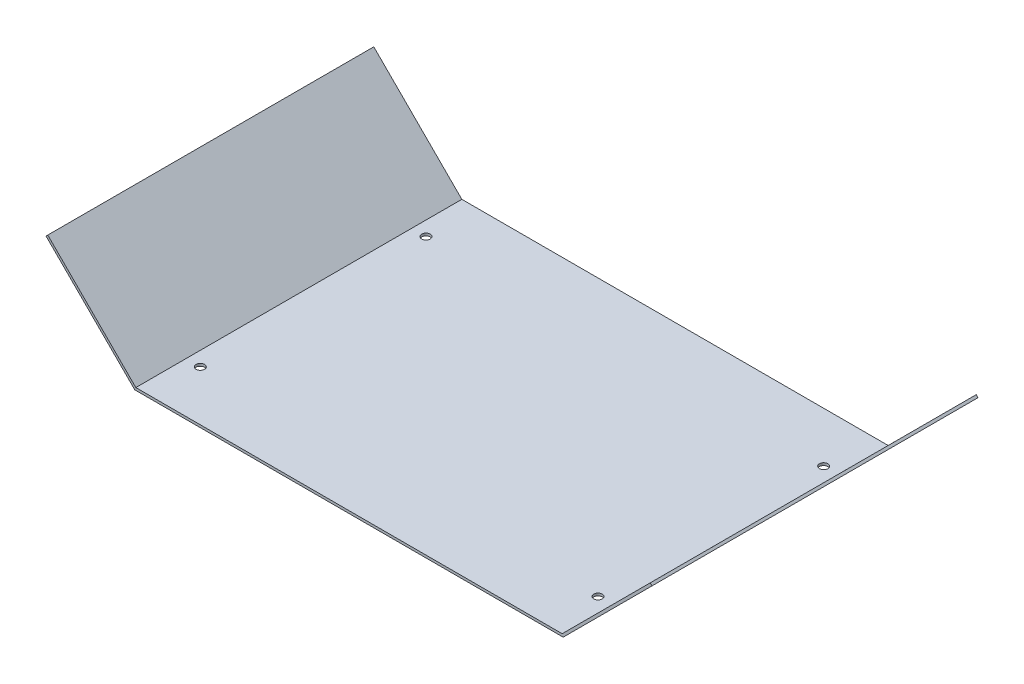
ISO-10303-21;
HEADER;
FILE_DESCRIPTION(('STEP AP214'),'2;1');
FILE_NAME('part.step','',(''),(''),'','','');
FILE_SCHEMA(('AUTOMOTIVE_DESIGN { 1 0 10303 214 1 1 1 1 }'));
ENDSEC;
DATA;
#1=APPLICATION_CONTEXT('core data for automotive mechanical design processes');
#2=APPLICATION_PROTOCOL_DEFINITION('international standard','automotive_design',2000,#1);
#3=PRODUCT_CONTEXT('',#1,'mechanical');
#4=PRODUCT('Part','Part','',(#3));
#5=PRODUCT_RELATED_PRODUCT_CATEGORY('part','',(#4));
#6=PRODUCT_DEFINITION_FORMATION('','',#4);
#7=PRODUCT_DEFINITION_CONTEXT('part definition',#1,'design');
#8=PRODUCT_DEFINITION('design','',#6,#7);
#9=PRODUCT_DEFINITION_SHAPE('','',#8);
#10=(LENGTH_UNIT() NAMED_UNIT(*) SI_UNIT(.MILLI.,.METRE.));
#11=(NAMED_UNIT(*) PLANE_ANGLE_UNIT() SI_UNIT($,.RADIAN.));
#12=(NAMED_UNIT(*) SI_UNIT($,.STERADIAN.) SOLID_ANGLE_UNIT());
#13=UNCERTAINTY_MEASURE_WITH_UNIT(LENGTH_MEASURE(1.E-05),#10,'distance_accuracy_value','');
#14=(GEOMETRIC_REPRESENTATION_CONTEXT(3) GLOBAL_UNCERTAINTY_ASSIGNED_CONTEXT((#13)) GLOBAL_UNIT_ASSIGNED_CONTEXT((#10,
#11,#12)) REPRESENTATION_CONTEXT('',''));
#15=CARTESIAN_POINT('',(0.,0.,0.));
#16=DIRECTION('',(0.,0.,1.));
#17=DIRECTION('',(1.,0.,0.));
#18=AXIS2_PLACEMENT_3D('',#15,#16,#17);
#19=CARTESIAN_POINT('',(146.649414842146,-0.707116678078054,130.));
#20=DIRECTION('',(-0.707096884156519,0.707116678078054,0.));
#21=DIRECTION('',(-0.707116678078054,-0.70709688415652,0.));
#22=AXIS2_PLACEMENT_3D('',#19,#20,#21);
#23=PLANE('',#22);
#24=DIRECTION('',(0.707116678078054,0.70709688415652,0.));
#25=VECTOR('',#24,1.);
#26=CARTESIAN_POINT('',(146.649414842146,-0.707116678078054,0.));
#27=LINE('',#26,#25);
#28=CARTESIAN_POINT('',(146.356523321475,-1.,0.));
#29=VERTEX_POINT('',#28);
#30=CARTESIAN_POINT('',(181.763414842145,34.4059003953664,0.));
#31=VERTEX_POINT('',#30);
#32=EDGE_CURVE('E128',#29,#31,#27,.T.);
#33=ORIENTED_EDGE('',*,*,#32,.T.);
#34=DIRECTION('',(0.,0.,-1.));
#35=VECTOR('',#34,1.);
#36=CARTESIAN_POINT('',(181.763414842145,34.4059003953664,130.));
#37=LINE('',#36,#35);
#38=CARTESIAN_POINT('',(181.763414842145,34.4059003953664,130.));
#39=VERTEX_POINT('',#38);
#40=EDGE_CURVE('E11',#39,#31,#37,.T.);
#41=ORIENTED_EDGE('',*,*,#40,.F.);
#42=DIRECTION('',(0.707116678078054,0.70709688415652,0.));
#43=VECTOR('',#42,1.);
#44=CARTESIAN_POINT('',(146.649414842146,-0.707116678078054,130.));
#45=LINE('',#44,#43);
#46=CARTESIAN_POINT('',(146.356523321475,-1.,130.));
#47=VERTEX_POINT('',#46);
#48=EDGE_CURVE('E86',#47,#39,#45,.T.);
#49=ORIENTED_EDGE('',*,*,#48,.F.);
#50=DIRECTION('',(0.,0.,-1.));
#51=VECTOR('',#50,1.);
#52=CARTESIAN_POINT('',(146.356523321475,-1.,130.));
#53=LINE('',#52,#51);
#54=EDGE_CURVE('E127',#47,#29,#53,.T.);
#55=ORIENTED_EDGE('',*,*,#54,.T.);
#56=EDGE_LOOP('',(#33,#41,#49,#55));
#57=FACE_BOUND('',#56,.T.);
#58=ADVANCED_FACE('F31',(#57),#23,.F.);
#59=CARTESIAN_POINT('',(181.056317957989,35.1130170734444,130.));
#60=DIRECTION('',(0.707116678078055,0.707096884156518,0.));
#61=DIRECTION('',(-0.707096884156518,0.707116678078055,0.));
#62=AXIS2_PLACEMENT_3D('',#59,#60,#61);
#63=PLANE('',#62);
#64=DIRECTION('',(0.707096884156518,-0.707116678078055,0.));
#65=VECTOR('',#64,1.);
#66=CARTESIAN_POINT('',(181.056317957989,35.1130170734444,0.));
#67=LINE('',#66,#65);
#68=CARTESIAN_POINT('',(181.056317957989,35.1130170734444,0.));
#69=VERTEX_POINT('',#68);
#70=EDGE_CURVE('E131',#69,#31,#67,.T.);
#71=ORIENTED_EDGE('',*,*,#70,.F.);
#72=DIRECTION('',(0.,0.,-1.));
#73=VECTOR('',#72,1.);
#74=CARTESIAN_POINT('',(181.056317957989,35.1130170734444,130.));
#75=LINE('',#74,#73);
#76=CARTESIAN_POINT('',(181.056317957989,35.1130170734444,130.));
#77=VERTEX_POINT('',#76);
#78=EDGE_CURVE('E39',#77,#69,#75,.T.);
#79=ORIENTED_EDGE('',*,*,#78,.F.);
#80=DIRECTION('',(0.707096884156518,-0.707116678078055,0.));
#81=VECTOR('',#80,1.);
#82=CARTESIAN_POINT('',(181.056317957989,35.1130170734444,130.));
#83=LINE('',#82,#81);
#84=EDGE_CURVE('E171',#77,#39,#83,.T.);
#85=ORIENTED_EDGE('',*,*,#84,.T.);
#86=ORIENTED_EDGE('',*,*,#40,.T.);
#87=EDGE_LOOP('',(#71,#79,#85,#86));
#88=FACE_BOUND('',#87,.T.);
#89=ADVANCED_FACE('F162',(#88),#63,.T.);
#90=CARTESIAN_POINT('',(145.942317957989,0.,130.));
#91=DIRECTION('',(-0.707096884156519,0.707116678078054,0.));
#92=DIRECTION('',(-0.707116678078054,-0.70709688415652,0.));
#93=AXIS2_PLACEMENT_3D('',#90,#91,#92);
#94=PLANE('',#93);
#95=DIRECTION('',(0.707116678078054,0.70709688415652,0.));
#96=VECTOR('',#95,1.);
#97=CARTESIAN_POINT('',(145.942317957989,0.,0.));
#98=LINE('',#97,#96);
#99=CARTESIAN_POINT('',(145.942317957989,0.,0.));
#100=VERTEX_POINT('',#99);
#101=EDGE_CURVE('E135',#100,#69,#98,.T.);
#102=ORIENTED_EDGE('',*,*,#101,.F.);
#103=DIRECTION('',(0.,0.,-1.));
#104=VECTOR('',#103,1.);
#105=CARTESIAN_POINT('',(145.942317957989,0.,130.));
#106=LINE('',#105,#104);
#107=CARTESIAN_POINT('',(145.942317957989,0.,130.));
#108=VERTEX_POINT('',#107);
#109=EDGE_CURVE('E152',#108,#100,#106,.T.);
#110=ORIENTED_EDGE('',*,*,#109,.F.);
#111=DIRECTION('',(0.707116678078054,0.70709688415652,0.));
#112=VECTOR('',#111,1.);
#113=CARTESIAN_POINT('',(145.942317957989,0.,130.));
#114=LINE('',#113,#112);
#115=EDGE_CURVE('E159',#108,#77,#114,.T.);
#116=ORIENTED_EDGE('',*,*,#115,.T.);
#117=ORIENTED_EDGE('',*,*,#78,.T.);
#118=EDGE_LOOP('',(#102,#110,#116,#117));
#119=FACE_BOUND('',#118,.T.);
#120=ADVANCED_FACE('F157',(#119),#94,.T.);
#121=CARTESIAN_POINT('',(-24.057682042011,0.,130.));
#122=DIRECTION('',(0.,1.,0.));
#123=DIRECTION('',(0.,0.,1.));
#124=AXIS2_PLACEMENT_3D('',#121,#122,#123);
#125=PLANE('',#124);
#126=CARTESIAN_POINT('',(-18.357682042011,0.,20.));
#127=DIRECTION('',(0.,1.,0.));
#128=DIRECTION('',(0.,0.,1.));
#129=AXIS2_PLACEMENT_3D('',#126,#127,#128);
#130=CIRCLE('',#129,1.69999999999999);
#131=CARTESIAN_POINT('',(-18.357682042011,0.,21.7));
#132=VERTEX_POINT('',#131);
#133=EDGE_CURVE('E196',#132,#132,#130,.T.);
#134=ORIENTED_EDGE('',*,*,#133,.F.);
#135=EDGE_LOOP('',(#134));
#136=FACE_BOUND('',#135,.T.);
#137=CARTESIAN_POINT('',(140.242317957989,0.,20.));
#138=DIRECTION('',(0.,1.,0.));
#139=DIRECTION('',(0.,0.,1.));
#140=AXIS2_PLACEMENT_3D('',#137,#138,#139);
#141=CIRCLE('',#140,1.69999999999998);
#142=CARTESIAN_POINT('',(140.242317957989,0.,21.7));
#143=VERTEX_POINT('',#142);
#144=EDGE_CURVE('E190',#143,#143,#141,.T.);
#145=ORIENTED_EDGE('',*,*,#144,.F.);
#146=EDGE_LOOP('',(#145));
#147=FACE_BOUND('',#146,.T.);
#148=CARTESIAN_POINT('',(140.242317957989,0.,110.));
#149=DIRECTION('',(0.,1.,0.));
#150=DIRECTION('',(0.,0.,1.));
#151=AXIS2_PLACEMENT_3D('',#148,#149,#150);
#152=CIRCLE('',#151,1.69999999999998);
#153=CARTESIAN_POINT('',(140.242317957989,0.,111.7));
#154=VERTEX_POINT('',#153);
#155=EDGE_CURVE('E184',#154,#154,#152,.T.);
#156=ORIENTED_EDGE('',*,*,#155,.F.);
#157=EDGE_LOOP('',(#156));
#158=FACE_BOUND('',#157,.T.);
#159=CARTESIAN_POINT('',(-18.357682042011,0.,110.));
#160=DIRECTION('',(0.,1.,0.));
#161=DIRECTION('',(0.,0.,1.));
#162=AXIS2_PLACEMENT_3D('',#159,#160,#161);
#163=CIRCLE('',#162,1.69999999999999);
#164=CARTESIAN_POINT('',(-18.357682042011,0.,111.7));
#165=VERTEX_POINT('',#164);
#166=EDGE_CURVE('E178',#165,#165,#163,.T.);
#167=ORIENTED_EDGE('',*,*,#166,.F.);
#168=EDGE_LOOP('',(#167));
#169=FACE_BOUND('',#168,.T.);
#170=DIRECTION('',(1.,0.,0.));
#171=VECTOR('',#170,1.);
#172=CARTESIAN_POINT('',(-24.057682042011,0.,0.));
#173=LINE('',#172,#171);
#174=CARTESIAN_POINT('',(-24.057682042011,0.,0.));
#175=VERTEX_POINT('',#174);
#176=EDGE_CURVE('E138',#175,#100,#173,.T.);
#177=ORIENTED_EDGE('',*,*,#176,.F.);
#178=DIRECTION('',(0.,0.,-1.));
#179=VECTOR('',#178,1.);
#180=CARTESIAN_POINT('',(-24.057682042011,0.,130.));
#181=LINE('',#180,#179);
#182=CARTESIAN_POINT('',(-24.057682042011,0.,130.));
#183=VERTEX_POINT('',#182);
#184=EDGE_CURVE('E150',#183,#175,#181,.T.);
#185=ORIENTED_EDGE('',*,*,#184,.F.);
#186=DIRECTION('',(1.,0.,0.));
#187=VECTOR('',#186,1.);
#188=CARTESIAN_POINT('',(-24.057682042011,0.,130.));
#189=LINE('',#188,#187);
#190=EDGE_CURVE('E122',#183,#108,#189,.T.);
#191=ORIENTED_EDGE('',*,*,#190,.T.);
#192=ORIENTED_EDGE('',*,*,#109,.T.);
#193=EDGE_LOOP('',(#177,#185,#191,#192));
#194=FACE_BOUND('',#193,.T.);
#195=ADVANCED_FACE('F169',(#136,#147,#158,#169,#194),#125,.T.);
#196=CARTESIAN_POINT('',(-59.1706991154554,35.114,130.));
#197=DIRECTION('',(0.707116678078054,0.707096884156519,0.));
#198=DIRECTION('',(-0.707096884156519,0.707116678078054,0.));
#199=AXIS2_PLACEMENT_3D('',#196,#197,#198);
#200=PLANE('',#199);
#201=DIRECTION('',(0.707096884156519,-0.707116678078054,0.));
#202=VECTOR('',#201,1.);
#203=CARTESIAN_POINT('',(-59.1706991154554,35.114,0.));
#204=LINE('',#203,#202);
#205=CARTESIAN_POINT('',(-59.1706991154554,35.114,0.));
#206=VERTEX_POINT('',#205);
#207=EDGE_CURVE('E141',#206,#175,#204,.T.);
#208=ORIENTED_EDGE('',*,*,#207,.F.);
#209=DIRECTION('',(0.,0.,-1.));
#210=VECTOR('',#209,1.);
#211=CARTESIAN_POINT('',(-59.1706991154554,35.114,130.));
#212=LINE('',#211,#210);
#213=CARTESIAN_POINT('',(-59.1706991154554,35.114,130.));
#214=VERTEX_POINT('',#213);
#215=EDGE_CURVE('E110',#214,#206,#212,.T.);
#216=ORIENTED_EDGE('',*,*,#215,.F.);
#217=DIRECTION('',(0.707096884156519,-0.707116678078054,0.));
#218=VECTOR('',#217,1.);
#219=CARTESIAN_POINT('',(-59.1706991154554,35.114,130.));
#220=LINE('',#219,#218);
#221=EDGE_CURVE('E120',#214,#183,#220,.T.);
#222=ORIENTED_EDGE('',*,*,#221,.T.);
#223=ORIENTED_EDGE('',*,*,#184,.T.);
#224=EDGE_LOOP('',(#208,#216,#222,#223));
#225=FACE_BOUND('',#224,.T.);
#226=ADVANCED_FACE('F204',(#225),#200,.T.);
#227=CARTESIAN_POINT('',(-59.8778157935335,34.4069031158435,130.));
#228=DIRECTION('',(-0.707096884156518,0.707116678078055,0.));
#229=DIRECTION('',(-0.707116678078055,-0.707096884156518,0.));
#230=AXIS2_PLACEMENT_3D('',#227,#228,#229);
#231=PLANE('',#230);
#232=DIRECTION('',(0.707116678078055,0.707096884156518,0.));
#233=VECTOR('',#232,1.);
#234=CARTESIAN_POINT('',(-59.8778157935335,34.4069031158435,0.));
#235=LINE('',#234,#233);
#236=CARTESIAN_POINT('',(-59.8778157935335,34.4069031158435,0.));
#237=VERTEX_POINT('',#236);
#238=EDGE_CURVE('E109',#237,#206,#235,.T.);
#239=ORIENTED_EDGE('',*,*,#238,.F.);
#240=DIRECTION('',(0.,0.,-1.));
#241=VECTOR('',#240,1.);
#242=CARTESIAN_POINT('',(-59.8778157935335,34.4069031158435,130.));
#243=LINE('',#242,#241);
#244=CARTESIAN_POINT('',(-59.8778157935335,34.4069031158435,130.));
#245=VERTEX_POINT('',#244);
#246=EDGE_CURVE('E103',#245,#237,#243,.T.);
#247=ORIENTED_EDGE('',*,*,#246,.F.);
#248=DIRECTION('',(0.707116678078055,0.707096884156518,0.));
#249=VECTOR('',#248,1.);
#250=CARTESIAN_POINT('',(-59.8778157935335,34.4069031158435,130.));
#251=LINE('',#250,#249);
#252=EDGE_CURVE('E107',#245,#214,#251,.T.);
#253=ORIENTED_EDGE('',*,*,#252,.T.);
#254=ORIENTED_EDGE('',*,*,#215,.T.);
#255=EDGE_LOOP('',(#239,#247,#253,#254));
#256=FACE_BOUND('',#255,.T.);
#257=ADVANCED_FACE('F105',(#256),#231,.T.);
#258=CARTESIAN_POINT('',(-59.8778157935335,34.4069031158435,130.));
#259=DIRECTION('',(0.707116678078054,0.707096884156519,0.));
#260=DIRECTION('',(-0.707096884156519,0.707116678078054,0.));
#261=AXIS2_PLACEMENT_3D('',#258,#259,#260);
#262=PLANE('',#261);
#263=DIRECTION('',(0.707096884156519,-0.707116678078054,0.));
#264=VECTOR('',#263,1.);
#265=CARTESIAN_POINT('',(-59.8778157935335,34.4069031158435,0.));
#266=LINE('',#265,#264);
#267=CARTESIAN_POINT('',(-24.4719038033186,-1.,0.));
#268=VERTEX_POINT('',#267);
#269=EDGE_CURVE('E74',#237,#268,#266,.T.);
#270=ORIENTED_EDGE('',*,*,#269,.T.);
#271=DIRECTION('',(0.,0.,-1.));
#272=VECTOR('',#271,1.);
#273=CARTESIAN_POINT('',(-24.4719038033186,-1.,130.));
#274=LINE('',#273,#272);
#275=CARTESIAN_POINT('',(-24.4719038033186,-1.,130.));
#276=VERTEX_POINT('',#275);
#277=EDGE_CURVE('E111',#276,#268,#274,.T.);
#278=ORIENTED_EDGE('',*,*,#277,.F.);
#279=DIRECTION('',(0.707096884156519,-0.707116678078054,0.));
#280=VECTOR('',#279,1.);
#281=CARTESIAN_POINT('',(-59.8778157935335,34.4069031158435,130.));
#282=LINE('',#281,#280);
#283=EDGE_CURVE('E113',#245,#276,#282,.T.);
#284=ORIENTED_EDGE('',*,*,#283,.F.);
#285=ORIENTED_EDGE('',*,*,#246,.T.);
#286=EDGE_LOOP('',(#270,#278,#284,#285));
#287=FACE_BOUND('',#286,.T.);
#288=ADVANCED_FACE('F114',(#287),#262,.F.);
#289=CARTESIAN_POINT('',(-24.057682042011,-1.,130.));
#290=DIRECTION('',(0.,1.,0.));
#291=DIRECTION('',(0.,0.,1.));
#292=AXIS2_PLACEMENT_3D('',#289,#290,#291);
#293=PLANE('',#292);
#294=CARTESIAN_POINT('',(-18.357682042011,-1.,20.));
#295=DIRECTION('',(0.,1.,0.));
#296=DIRECTION('',(0.,0.,1.));
#297=AXIS2_PLACEMENT_3D('',#294,#295,#296);
#298=CIRCLE('',#297,1.7);
#299=CARTESIAN_POINT('',(-18.357682042011,-1.,21.7));
#300=VERTEX_POINT('',#299);
#301=EDGE_CURVE('E193',#300,#300,#298,.T.);
#302=ORIENTED_EDGE('',*,*,#301,.T.);
#303=EDGE_LOOP('',(#302));
#304=FACE_BOUND('',#303,.T.);
#305=CARTESIAN_POINT('',(140.242317957989,-1.,20.));
#306=DIRECTION('',(0.,1.,0.));
#307=DIRECTION('',(0.,0.,1.));
#308=AXIS2_PLACEMENT_3D('',#305,#306,#307);
#309=CIRCLE('',#308,1.70000000000001);
#310=CARTESIAN_POINT('',(140.242317957989,-1.,21.7));
#311=VERTEX_POINT('',#310);
#312=EDGE_CURVE('E187',#311,#311,#309,.T.);
#313=ORIENTED_EDGE('',*,*,#312,.T.);
#314=EDGE_LOOP('',(#313));
#315=FACE_BOUND('',#314,.T.);
#316=CARTESIAN_POINT('',(140.242317957989,-1.,110.));
#317=DIRECTION('',(0.,1.,0.));
#318=DIRECTION('',(0.,0.,1.));
#319=AXIS2_PLACEMENT_3D('',#316,#317,#318);
#320=CIRCLE('',#319,1.70000000000001);
#321=CARTESIAN_POINT('',(140.242317957989,-1.,111.7));
#322=VERTEX_POINT('',#321);
#323=EDGE_CURVE('E181',#322,#322,#320,.T.);
#324=ORIENTED_EDGE('',*,*,#323,.T.);
#325=EDGE_LOOP('',(#324));
#326=FACE_BOUND('',#325,.T.);
#327=CARTESIAN_POINT('',(-18.357682042011,-1.,110.));
#328=DIRECTION('',(0.,1.,0.));
#329=DIRECTION('',(0.,0.,1.));
#330=AXIS2_PLACEMENT_3D('',#327,#328,#329);
#331=CIRCLE('',#330,1.7);
#332=CARTESIAN_POINT('',(-18.357682042011,-1.,111.7));
#333=VERTEX_POINT('',#332);
#334=EDGE_CURVE('E132',#333,#333,#331,.T.);
#335=ORIENTED_EDGE('',*,*,#334,.T.);
#336=EDGE_LOOP('',(#335));
#337=FACE_BOUND('',#336,.T.);
#338=DIRECTION('',(1.,0.,0.));
#339=VECTOR('',#338,1.);
#340=CARTESIAN_POINT('',(-24.057682042011,-1.,0.));
#341=LINE('',#340,#339);
#342=EDGE_CURVE('E80',#268,#29,#341,.T.);
#343=ORIENTED_EDGE('',*,*,#342,.T.);
#344=ORIENTED_EDGE('',*,*,#54,.F.);
#345=DIRECTION('',(1.,0.,0.));
#346=VECTOR('',#345,1.);
#347=CARTESIAN_POINT('',(-24.057682042011,-1.,130.));
#348=LINE('',#347,#346);
#349=EDGE_CURVE('E47',#276,#47,#348,.T.);
#350=ORIENTED_EDGE('',*,*,#349,.F.);
#351=ORIENTED_EDGE('',*,*,#277,.T.);
#352=EDGE_LOOP('',(#343,#344,#350,#351));
#353=FACE_BOUND('',#352,.T.);
#354=ADVANCED_FACE('F232',(#304,#315,#326,#337,#353),#293,.F.);
#355=CARTESIAN_POINT('',(181.763414842145,34.4059003953664,130.));
#356=DIRECTION('',(0.,0.,-1.));
#357=DIRECTION('',(-1.,0.,0.));
#358=AXIS2_PLACEMENT_3D('',#355,#356,#357);
#359=PLANE('',#358);
#360=ORIENTED_EDGE('',*,*,#48,.T.);
#361=ORIENTED_EDGE('',*,*,#84,.F.);
#362=ORIENTED_EDGE('',*,*,#115,.F.);
#363=ORIENTED_EDGE('',*,*,#190,.F.);
#364=ORIENTED_EDGE('',*,*,#221,.F.);
#365=ORIENTED_EDGE('',*,*,#252,.F.);
#366=ORIENTED_EDGE('',*,*,#283,.T.);
#367=ORIENTED_EDGE('',*,*,#349,.T.);
#368=EDGE_LOOP('',(#360,#361,#362,#363,#364,#365,#366,#367));
#369=FACE_BOUND('',#368,.T.);
#370=ADVANCED_FACE('F117',(#369),#359,.F.);
#371=CARTESIAN_POINT('',(181.763414842145,34.4059003953664,0.));
#372=DIRECTION('',(0.,0.,-1.));
#373=DIRECTION('',(-1.,0.,0.));
#374=AXIS2_PLACEMENT_3D('',#371,#372,#373);
#375=PLANE('',#374);
#376=ORIENTED_EDGE('',*,*,#32,.F.);
#377=ORIENTED_EDGE('',*,*,#342,.F.);
#378=ORIENTED_EDGE('',*,*,#269,.F.);
#379=ORIENTED_EDGE('',*,*,#238,.T.);
#380=ORIENTED_EDGE('',*,*,#207,.T.);
#381=ORIENTED_EDGE('',*,*,#176,.T.);
#382=ORIENTED_EDGE('',*,*,#101,.T.);
#383=ORIENTED_EDGE('',*,*,#70,.T.);
#384=EDGE_LOOP('',(#376,#377,#378,#379,#380,#381,#382,#383));
#385=FACE_BOUND('',#384,.T.);
#386=ADVANCED_FACE('F165',(#385),#375,.T.);
#387=CARTESIAN_POINT('',(-18.357682042011,0.,110.));
#388=DIRECTION('',(0.,1.,0.));
#389=DIRECTION('',(0.,0.,1.));
#390=AXIS2_PLACEMENT_3D('',#387,#388,#389);
#391=CYLINDRICAL_SURFACE('',#390,1.69999999999999);
#392=ORIENTED_EDGE('',*,*,#334,.F.);
#393=EDGE_LOOP('',(#392));
#394=FACE_BOUND('',#393,.T.);
#395=ORIENTED_EDGE('',*,*,#166,.T.);
#396=EDGE_LOOP('',(#395));
#397=FACE_BOUND('',#396,.T.);
#398=ADVANCED_FACE('F212',(#394,#397),#391,.F.);
#399=CARTESIAN_POINT('',(140.242317957989,0.,110.));
#400=DIRECTION('',(0.,1.,0.));
#401=DIRECTION('',(0.,0.,1.));
#402=AXIS2_PLACEMENT_3D('',#399,#400,#401);
#403=CYLINDRICAL_SURFACE('',#402,1.69999999999999);
#404=ORIENTED_EDGE('',*,*,#323,.F.);
#405=EDGE_LOOP('',(#404));
#406=FACE_BOUND('',#405,.T.);
#407=ORIENTED_EDGE('',*,*,#155,.T.);
#408=EDGE_LOOP('',(#407));
#409=FACE_BOUND('',#408,.T.);
#410=ADVANCED_FACE('F214',(#406,#409),#403,.F.);
#411=CARTESIAN_POINT('',(140.242317957989,0.,20.));
#412=DIRECTION('',(0.,1.,0.));
#413=DIRECTION('',(0.,0.,1.));
#414=AXIS2_PLACEMENT_3D('',#411,#412,#413);
#415=CYLINDRICAL_SURFACE('',#414,1.69999999999999);
#416=ORIENTED_EDGE('',*,*,#312,.F.);
#417=EDGE_LOOP('',(#416));
#418=FACE_BOUND('',#417,.T.);
#419=ORIENTED_EDGE('',*,*,#144,.T.);
#420=EDGE_LOOP('',(#419));
#421=FACE_BOUND('',#420,.T.);
#422=ADVANCED_FACE('F221',(#418,#421),#415,.F.);
#423=CARTESIAN_POINT('',(-18.357682042011,0.,20.));
#424=DIRECTION('',(0.,1.,0.));
#425=DIRECTION('',(0.,0.,1.));
#426=AXIS2_PLACEMENT_3D('',#423,#424,#425);
#427=CYLINDRICAL_SURFACE('',#426,1.69999999999999);
#428=ORIENTED_EDGE('',*,*,#301,.F.);
#429=EDGE_LOOP('',(#428));
#430=FACE_BOUND('',#429,.T.);
#431=ORIENTED_EDGE('',*,*,#133,.T.);
#432=EDGE_LOOP('',(#431));
#433=FACE_BOUND('',#432,.T.);
#434=ADVANCED_FACE('F200',(#430,#433),#427,.F.);
#435=CLOSED_SHELL('',(#58,#89,#120,#195,#226,#257,#288,#354,#370,#386,#398,#410,#422,#434));
#436=MANIFOLD_SOLID_BREP('B2',#435);
#437=ADVANCED_BREP_SHAPE_REPRESENTATION('',(#18,#436),#14);
#438=SHAPE_DEFINITION_REPRESENTATION(#9,#437);
ENDSEC;
END-ISO-10303-21;
